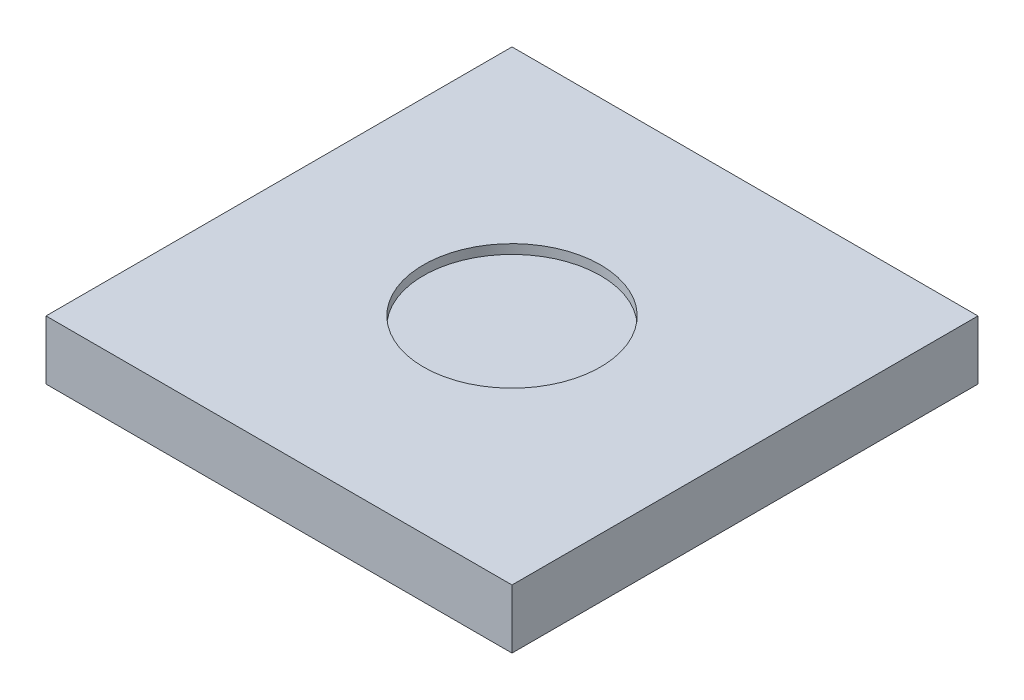
ISO-10303-21;
HEADER;
FILE_DESCRIPTION(('STEP AP214'),'2;1');
FILE_NAME('part.step','',(''),(''),'','','');
FILE_SCHEMA(('AUTOMOTIVE_DESIGN { 1 0 10303 214 1 1 1 1 }'));
ENDSEC;
DATA;
#1=APPLICATION_CONTEXT('core data for automotive mechanical design processes');
#2=APPLICATION_PROTOCOL_DEFINITION('international standard','automotive_design',2000,#1);
#3=PRODUCT_CONTEXT('',#1,'mechanical');
#4=PRODUCT('Part','Part','',(#3));
#5=PRODUCT_RELATED_PRODUCT_CATEGORY('part','',(#4));
#6=PRODUCT_DEFINITION_FORMATION('','',#4);
#7=PRODUCT_DEFINITION_CONTEXT('part definition',#1,'design');
#8=PRODUCT_DEFINITION('design','',#6,#7);
#9=PRODUCT_DEFINITION_SHAPE('','',#8);
#10=(LENGTH_UNIT() NAMED_UNIT(*) SI_UNIT(.MILLI.,.METRE.));
#11=(NAMED_UNIT(*) PLANE_ANGLE_UNIT() SI_UNIT($,.RADIAN.));
#12=(NAMED_UNIT(*) SI_UNIT($,.STERADIAN.) SOLID_ANGLE_UNIT());
#13=UNCERTAINTY_MEASURE_WITH_UNIT(LENGTH_MEASURE(1.E-05),#10,'distance_accuracy_value','');
#14=(GEOMETRIC_REPRESENTATION_CONTEXT(3) GLOBAL_UNCERTAINTY_ASSIGNED_CONTEXT((#13)) GLOBAL_UNIT_ASSIGNED_CONTEXT((#10,
#11,#12)) REPRESENTATION_CONTEXT('',''));
#15=CARTESIAN_POINT('',(0.,0.,0.));
#16=DIRECTION('',(0.,0.,1.));
#17=DIRECTION('',(1.,0.,0.));
#18=AXIS2_PLACEMENT_3D('',#15,#16,#17);
#19=CARTESIAN_POINT('',(0.,19.,0.));
#20=DIRECTION('',(1.,0.,0.));
#21=DIRECTION('',(0.,0.,-1.));
#22=AXIS2_PLACEMENT_3D('',#19,#20,#21);
#23=PLANE('',#22);
#24=DIRECTION('',(0.,0.,1.));
#25=VECTOR('',#24,1.);
#26=CARTESIAN_POINT('',(0.,0.,0.));
#27=LINE('',#26,#25);
#28=CARTESIAN_POINT('',(0.,0.,-150.));
#29=VERTEX_POINT('',#28);
#30=CARTESIAN_POINT('',(0.,0.,0.));
#31=VERTEX_POINT('',#30);
#32=EDGE_CURVE('E100',#29,#31,#27,.T.);
#33=ORIENTED_EDGE('',*,*,#32,.T.);
#34=DIRECTION('',(0.,-1.,0.));
#35=VECTOR('',#34,1.);
#36=CARTESIAN_POINT('',(0.,19.,0.));
#37=LINE('',#36,#35);
#38=CARTESIAN_POINT('',(0.,19.,0.));
#39=VERTEX_POINT('',#38);
#40=EDGE_CURVE('E11',#39,#31,#37,.T.);
#41=ORIENTED_EDGE('',*,*,#40,.F.);
#42=DIRECTION('',(0.,0.,1.));
#43=VECTOR('',#42,1.);
#44=CARTESIAN_POINT('',(0.,19.,0.));
#45=LINE('',#44,#43);
#46=CARTESIAN_POINT('',(0.,19.,-150.));
#47=VERTEX_POINT('',#46);
#48=EDGE_CURVE('E88',#47,#39,#45,.T.);
#49=ORIENTED_EDGE('',*,*,#48,.F.);
#50=DIRECTION('',(0.,-1.,0.));
#51=VECTOR('',#50,1.);
#52=CARTESIAN_POINT('',(0.,19.,-150.));
#53=LINE('',#52,#51);
#54=EDGE_CURVE('E96',#47,#29,#53,.T.);
#55=ORIENTED_EDGE('',*,*,#54,.T.);
#56=EDGE_LOOP('',(#33,#41,#49,#55));
#57=FACE_BOUND('',#56,.T.);
#58=ADVANCED_FACE('F37',(#57),#23,.F.);
#59=CARTESIAN_POINT('',(0.,19.,0.));
#60=DIRECTION('',(0.,0.,-1.));
#61=DIRECTION('',(-1.,0.,0.));
#62=AXIS2_PLACEMENT_3D('',#59,#60,#61);
#63=PLANE('',#62);
#64=DIRECTION('',(1.,0.,0.));
#65=VECTOR('',#64,1.);
#66=CARTESIAN_POINT('',(0.,0.,0.));
#67=LINE('',#66,#65);
#68=CARTESIAN_POINT('',(150.,0.,0.));
#69=VERTEX_POINT('',#68);
#70=EDGE_CURVE('E92',#31,#69,#67,.T.);
#71=ORIENTED_EDGE('',*,*,#70,.T.);
#72=DIRECTION('',(0.,-1.,0.));
#73=VECTOR('',#72,1.);
#74=CARTESIAN_POINT('',(150.,19.,0.));
#75=LINE('',#74,#73);
#76=CARTESIAN_POINT('',(150.,19.,0.));
#77=VERTEX_POINT('',#76);
#78=EDGE_CURVE('E45',#77,#69,#75,.T.);
#79=ORIENTED_EDGE('',*,*,#78,.F.);
#80=DIRECTION('',(1.,0.,0.));
#81=VECTOR('',#80,1.);
#82=CARTESIAN_POINT('',(0.,19.,0.));
#83=LINE('',#82,#81);
#84=EDGE_CURVE('E83',#39,#77,#83,.T.);
#85=ORIENTED_EDGE('',*,*,#84,.F.);
#86=ORIENTED_EDGE('',*,*,#40,.T.);
#87=EDGE_LOOP('',(#71,#79,#85,#86));
#88=FACE_BOUND('',#87,.T.);
#89=ADVANCED_FACE('F91',(#88),#63,.F.);
#90=CARTESIAN_POINT('',(150.,19.,0.));
#91=DIRECTION('',(-1.,0.,0.));
#92=DIRECTION('',(0.,0.,1.));
#93=AXIS2_PLACEMENT_3D('',#90,#91,#92);
#94=PLANE('',#93);
#95=DIRECTION('',(0.,0.,-1.));
#96=VECTOR('',#95,1.);
#97=CARTESIAN_POINT('',(150.,0.,0.));
#98=LINE('',#97,#96);
#99=CARTESIAN_POINT('',(150.,0.,-150.));
#100=VERTEX_POINT('',#99);
#101=EDGE_CURVE('E70',#69,#100,#98,.T.);
#102=ORIENTED_EDGE('',*,*,#101,.T.);
#103=DIRECTION('',(0.,-1.,0.));
#104=VECTOR('',#103,1.);
#105=CARTESIAN_POINT('',(150.,19.,-150.));
#106=LINE('',#105,#104);
#107=CARTESIAN_POINT('',(150.,19.,-150.));
#108=VERTEX_POINT('',#107);
#109=EDGE_CURVE('E93',#108,#100,#106,.T.);
#110=ORIENTED_EDGE('',*,*,#109,.F.);
#111=DIRECTION('',(0.,0.,-1.));
#112=VECTOR('',#111,1.);
#113=CARTESIAN_POINT('',(150.,19.,0.));
#114=LINE('',#113,#112);
#115=EDGE_CURVE('E86',#77,#108,#114,.T.);
#116=ORIENTED_EDGE('',*,*,#115,.F.);
#117=ORIENTED_EDGE('',*,*,#78,.T.);
#118=EDGE_LOOP('',(#102,#110,#116,#117));
#119=FACE_BOUND('',#118,.T.);
#120=ADVANCED_FACE('F94',(#119),#94,.F.);
#121=CARTESIAN_POINT('',(0.,19.,-150.));
#122=DIRECTION('',(0.,0.,1.));
#123=DIRECTION('',(1.,0.,0.));
#124=AXIS2_PLACEMENT_3D('',#121,#122,#123);
#125=PLANE('',#124);
#126=DIRECTION('',(-1.,0.,0.));
#127=VECTOR('',#126,1.);
#128=CARTESIAN_POINT('',(0.,0.,-150.));
#129=LINE('',#128,#127);
#130=EDGE_CURVE('E76',#100,#29,#129,.T.);
#131=ORIENTED_EDGE('',*,*,#130,.T.);
#132=ORIENTED_EDGE('',*,*,#54,.F.);
#133=DIRECTION('',(-1.,0.,0.));
#134=VECTOR('',#133,1.);
#135=CARTESIAN_POINT('',(0.,19.,-150.));
#136=LINE('',#135,#134);
#137=EDGE_CURVE('E53',#108,#47,#136,.T.);
#138=ORIENTED_EDGE('',*,*,#137,.F.);
#139=ORIENTED_EDGE('',*,*,#109,.T.);
#140=EDGE_LOOP('',(#131,#132,#138,#139));
#141=FACE_BOUND('',#140,.T.);
#142=ADVANCED_FACE('F108',(#141),#125,.F.);
#143=CARTESIAN_POINT('',(0.,19.,0.));
#144=DIRECTION('',(0.,-1.,0.));
#145=DIRECTION('',(0.,0.,-1.));
#146=AXIS2_PLACEMENT_3D('',#143,#144,#145);
#147=PLANE('',#146);
#148=CARTESIAN_POINT('',(75.,19.,-75.));
#149=DIRECTION('',(0.,1.,0.));
#150=DIRECTION('',(0.,0.,1.));
#151=AXIS2_PLACEMENT_3D('',#148,#149,#150);
#152=CIRCLE('',#151,28.5);
#153=CARTESIAN_POINT('',(75.,19.,-46.5));
#154=VERTEX_POINT('',#153);
#155=EDGE_CURVE('E114',#154,#154,#152,.T.);
#156=ORIENTED_EDGE('',*,*,#155,.F.);
#157=EDGE_LOOP('',(#156));
#158=FACE_BOUND('',#157,.T.);
#159=ORIENTED_EDGE('',*,*,#48,.T.);
#160=ORIENTED_EDGE('',*,*,#84,.T.);
#161=ORIENTED_EDGE('',*,*,#115,.T.);
#162=ORIENTED_EDGE('',*,*,#137,.T.);
#163=EDGE_LOOP('',(#159,#160,#161,#162));
#164=FACE_BOUND('',#163,.T.);
#165=ADVANCED_FACE('F84',(#158,#164),#147,.F.);
#166=CARTESIAN_POINT('',(0.,0.,0.));
#167=DIRECTION('',(0.,-1.,0.));
#168=DIRECTION('',(0.,0.,-1.));
#169=AXIS2_PLACEMENT_3D('',#166,#167,#168);
#170=PLANE('',#169);
#171=ORIENTED_EDGE('',*,*,#32,.F.);
#172=ORIENTED_EDGE('',*,*,#130,.F.);
#173=ORIENTED_EDGE('',*,*,#101,.F.);
#174=ORIENTED_EDGE('',*,*,#70,.F.);
#175=EDGE_LOOP('',(#171,#172,#173,#174));
#176=FACE_BOUND('',#175,.T.);
#177=ADVANCED_FACE('F111',(#176),#170,.T.);
#178=CARTESIAN_POINT('',(75.,16.,-75.));
#179=DIRECTION('',(0.,1.,0.));
#180=DIRECTION('',(0.,0.,1.));
#181=AXIS2_PLACEMENT_3D('',#178,#179,#180);
#182=CYLINDRICAL_SURFACE('',#181,28.5);
#183=CARTESIAN_POINT('',(75.,16.,-75.));
#184=DIRECTION('',(0.,1.,0.));
#185=DIRECTION('',(0.,0.,1.));
#186=AXIS2_PLACEMENT_3D('',#183,#184,#185);
#187=CIRCLE('',#186,28.5);
#188=CARTESIAN_POINT('',(75.,16.,-46.5));
#189=VERTEX_POINT('',#188);
#190=EDGE_CURVE('E103',#189,#189,#187,.T.);
#191=ORIENTED_EDGE('',*,*,#190,.F.);
#192=EDGE_LOOP('',(#191));
#193=FACE_BOUND('',#192,.T.);
#194=ORIENTED_EDGE('',*,*,#155,.T.);
#195=EDGE_LOOP('',(#194));
#196=FACE_BOUND('',#195,.T.);
#197=ADVANCED_FACE('F122',(#193,#196),#182,.F.);
#198=CARTESIAN_POINT('',(75.,16.,-75.));
#199=DIRECTION('',(0.,1.,0.));
#200=DIRECTION('',(0.,0.,1.));
#201=AXIS2_PLACEMENT_3D('',#198,#199,#200);
#202=PLANE('',#201);
#203=ORIENTED_EDGE('',*,*,#190,.T.);
#204=EDGE_LOOP('',(#203));
#205=FACE_BOUND('',#204,.T.);
#206=ADVANCED_FACE('F120',(#205),#202,.T.);
#207=CLOSED_SHELL('',(#58,#89,#120,#142,#165,#177,#197,#206));
#208=MANIFOLD_SOLID_BREP('B2',#207);
#209=ADVANCED_BREP_SHAPE_REPRESENTATION('',(#18,#208),#14);
#210=SHAPE_DEFINITION_REPRESENTATION(#9,#209);
ENDSEC;
END-ISO-10303-21;
